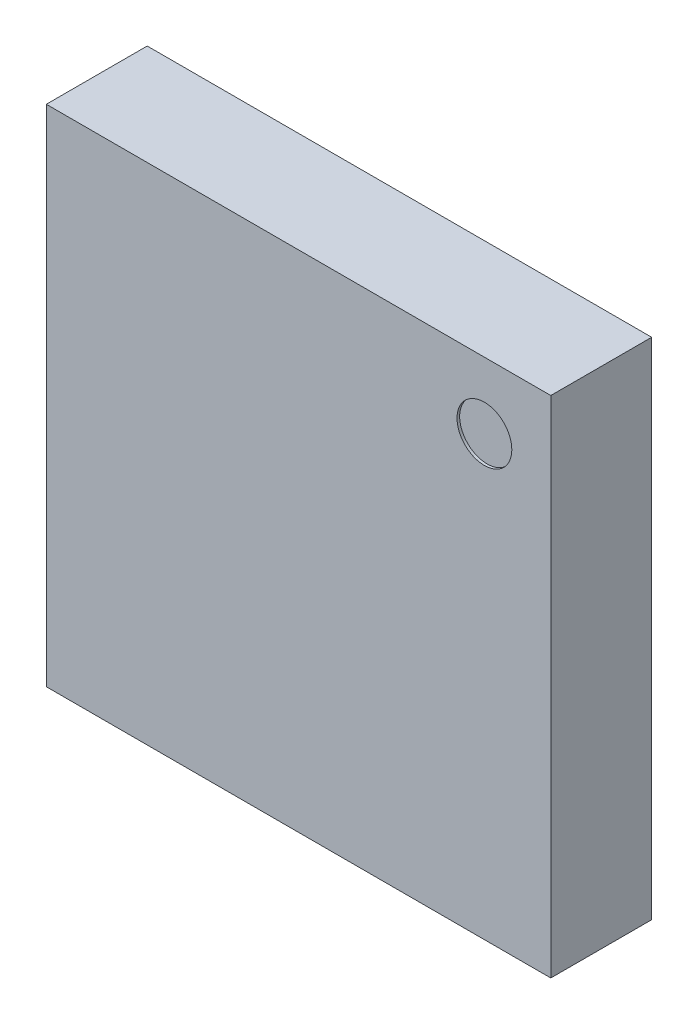
ISO-10303-21;
HEADER;
FILE_DESCRIPTION(('STEP AP214'),'2;1');
FILE_NAME('part.step','',(''),(''),'','','');
FILE_SCHEMA(('AUTOMOTIVE_DESIGN { 1 0 10303 214 1 1 1 1 }'));
ENDSEC;
DATA;
#1=APPLICATION_CONTEXT('core data for automotive mechanical design processes');
#2=APPLICATION_PROTOCOL_DEFINITION('international standard','automotive_design',2000,#1);
#3=PRODUCT_CONTEXT('',#1,'mechanical');
#4=PRODUCT('Part','Part','',(#3));
#5=PRODUCT_RELATED_PRODUCT_CATEGORY('part','',(#4));
#6=PRODUCT_DEFINITION_FORMATION('','',#4);
#7=PRODUCT_DEFINITION_CONTEXT('part definition',#1,'design');
#8=PRODUCT_DEFINITION('design','',#6,#7);
#9=PRODUCT_DEFINITION_SHAPE('','',#8);
#10=(LENGTH_UNIT() NAMED_UNIT(*) SI_UNIT(.MILLI.,.METRE.));
#11=(NAMED_UNIT(*) PLANE_ANGLE_UNIT() SI_UNIT($,.RADIAN.));
#12=(NAMED_UNIT(*) SI_UNIT($,.STERADIAN.) SOLID_ANGLE_UNIT());
#13=UNCERTAINTY_MEASURE_WITH_UNIT(LENGTH_MEASURE(1.E-05),#10,'distance_accuracy_value','');
#14=(GEOMETRIC_REPRESENTATION_CONTEXT(3) GLOBAL_UNCERTAINTY_ASSIGNED_CONTEXT((#13)) GLOBAL_UNIT_ASSIGNED_CONTEXT((#10,
#11,#12)) REPRESENTATION_CONTEXT('',''));
#15=CARTESIAN_POINT('',(0.,0.,0.));
#16=DIRECTION('',(0.,0.,1.));
#17=DIRECTION('',(1.,0.,0.));
#18=AXIS2_PLACEMENT_3D('',#15,#16,#17);
#19=CARTESIAN_POINT('',(0.95,0.95,0.38));
#20=DIRECTION('',(-1.,0.,0.));
#21=DIRECTION('',(0.,-1.,0.));
#22=AXIS2_PLACEMENT_3D('',#19,#20,#21);
#23=PLANE('',#22);
#24=DIRECTION('',(0.,1.,0.));
#25=VECTOR('',#24,1.);
#26=CARTESIAN_POINT('',(0.95,0.95,0.));
#27=LINE('',#26,#25);
#28=CARTESIAN_POINT('',(0.95,-0.95,0.));
#29=VERTEX_POINT('',#28);
#30=CARTESIAN_POINT('',(0.95,0.95,0.));
#31=VERTEX_POINT('',#30);
#32=EDGE_CURVE('E124',#29,#31,#27,.T.);
#33=ORIENTED_EDGE('',*,*,#32,.T.);
#34=DIRECTION('',(0.,0.,-1.));
#35=VECTOR('',#34,1.);
#36=CARTESIAN_POINT('',(0.95,0.95,0.38));
#37=LINE('',#36,#35);
#38=CARTESIAN_POINT('',(0.95,0.95,0.38));
#39=VERTEX_POINT('',#38);
#40=EDGE_CURVE('E113',#39,#31,#37,.T.);
#41=ORIENTED_EDGE('',*,*,#40,.F.);
#42=DIRECTION('',(0.,1.,0.));
#43=VECTOR('',#42,1.);
#44=CARTESIAN_POINT('',(0.95,0.95,0.38));
#45=LINE('',#44,#43);
#46=CARTESIAN_POINT('',(0.95,-0.95,0.38));
#47=VERTEX_POINT('',#46);
#48=EDGE_CURVE('E105',#47,#39,#45,.T.);
#49=ORIENTED_EDGE('',*,*,#48,.F.);
#50=DIRECTION('',(0.,0.,-1.));
#51=VECTOR('',#50,1.);
#52=CARTESIAN_POINT('',(0.95,-0.95,0.38));
#53=LINE('',#52,#51);
#54=EDGE_CURVE('E120',#47,#29,#53,.T.);
#55=ORIENTED_EDGE('',*,*,#54,.T.);
#56=EDGE_LOOP('',(#33,#41,#49,#55));
#57=FACE_BOUND('',#56,.T.);
#58=ADVANCED_FACE('F51',(#57),#23,.F.);
#59=CARTESIAN_POINT('',(-0.95,0.95,0.38));
#60=DIRECTION('',(0.,-1.,0.));
#61=DIRECTION('',(0.,0.,-1.));
#62=AXIS2_PLACEMENT_3D('',#59,#60,#61);
#63=PLANE('',#62);
#64=DIRECTION('',(-1.,0.,0.));
#65=VECTOR('',#64,1.);
#66=CARTESIAN_POINT('',(-0.95,0.95,0.));
#67=LINE('',#66,#65);
#68=CARTESIAN_POINT('',(-0.95,0.95,0.));
#69=VERTEX_POINT('',#68);
#70=EDGE_CURVE('E111',#31,#69,#67,.T.);
#71=ORIENTED_EDGE('',*,*,#70,.T.);
#72=DIRECTION('',(0.,0.,-1.));
#73=VECTOR('',#72,1.);
#74=CARTESIAN_POINT('',(-0.95,0.95,0.38));
#75=LINE('',#74,#73);
#76=CARTESIAN_POINT('',(-0.95,0.95,0.38));
#77=VERTEX_POINT('',#76);
#78=EDGE_CURVE('E109',#77,#69,#75,.T.);
#79=ORIENTED_EDGE('',*,*,#78,.F.);
#80=DIRECTION('',(-1.,0.,0.));
#81=VECTOR('',#80,1.);
#82=CARTESIAN_POINT('',(-0.95,0.95,0.38));
#83=LINE('',#82,#81);
#84=EDGE_CURVE('E100',#39,#77,#83,.T.);
#85=ORIENTED_EDGE('',*,*,#84,.F.);
#86=ORIENTED_EDGE('',*,*,#40,.T.);
#87=EDGE_LOOP('',(#71,#79,#85,#86));
#88=FACE_BOUND('',#87,.T.);
#89=ADVANCED_FACE('F110',(#88),#63,.F.);
#90=CARTESIAN_POINT('',(-0.95,0.95,0.38));
#91=DIRECTION('',(1.,0.,0.));
#92=DIRECTION('',(0.,1.,0.));
#93=AXIS2_PLACEMENT_3D('',#90,#91,#92);
#94=PLANE('',#93);
#95=DIRECTION('',(0.,-1.,0.));
#96=VECTOR('',#95,1.);
#97=CARTESIAN_POINT('',(-0.95,0.95,0.));
#98=LINE('',#97,#96);
#99=CARTESIAN_POINT('',(-0.95,-0.95,0.));
#100=VERTEX_POINT('',#99);
#101=EDGE_CURVE('E86',#69,#100,#98,.T.);
#102=ORIENTED_EDGE('',*,*,#101,.T.);
#103=DIRECTION('',(0.,0.,-1.));
#104=VECTOR('',#103,1.);
#105=CARTESIAN_POINT('',(-0.95,-0.95,0.38));
#106=LINE('',#105,#104);
#107=CARTESIAN_POINT('',(-0.95,-0.95,0.38));
#108=VERTEX_POINT('',#107);
#109=EDGE_CURVE('E114',#108,#100,#106,.T.);
#110=ORIENTED_EDGE('',*,*,#109,.F.);
#111=DIRECTION('',(0.,-1.,0.));
#112=VECTOR('',#111,1.);
#113=CARTESIAN_POINT('',(-0.95,0.95,0.38));
#114=LINE('',#113,#112);
#115=EDGE_CURVE('E103',#77,#108,#114,.T.);
#116=ORIENTED_EDGE('',*,*,#115,.F.);
#117=ORIENTED_EDGE('',*,*,#78,.T.);
#118=EDGE_LOOP('',(#102,#110,#116,#117));
#119=FACE_BOUND('',#118,.T.);
#120=ADVANCED_FACE('F116',(#119),#94,.F.);
#121=CARTESIAN_POINT('',(-0.95,-0.95,0.38));
#122=DIRECTION('',(0.,1.,0.));
#123=DIRECTION('',(0.,0.,1.));
#124=AXIS2_PLACEMENT_3D('',#121,#122,#123);
#125=PLANE('',#124);
#126=DIRECTION('',(1.,0.,0.));
#127=VECTOR('',#126,1.);
#128=CARTESIAN_POINT('',(-0.95,-0.95,0.));
#129=LINE('',#128,#127);
#130=EDGE_CURVE('E92',#100,#29,#129,.T.);
#131=ORIENTED_EDGE('',*,*,#130,.T.);
#132=ORIENTED_EDGE('',*,*,#54,.F.);
#133=DIRECTION('',(1.,0.,0.));
#134=VECTOR('',#133,1.);
#135=CARTESIAN_POINT('',(-0.95,-0.95,0.38));
#136=LINE('',#135,#134);
#137=EDGE_CURVE('E69',#108,#47,#136,.T.);
#138=ORIENTED_EDGE('',*,*,#137,.F.);
#139=ORIENTED_EDGE('',*,*,#109,.T.);
#140=EDGE_LOOP('',(#131,#132,#138,#139));
#141=FACE_BOUND('',#140,.T.);
#142=ADVANCED_FACE('F226',(#141),#125,.F.);
#143=CARTESIAN_POINT('',(0.,0.,0.38));
#144=DIRECTION('',(0.,0.,1.));
#145=DIRECTION('',(1.,0.,0.));
#146=AXIS2_PLACEMENT_3D('',#143,#144,#145);
#147=PLANE('',#146);
#148=CARTESIAN_POINT('',(0.7,0.7,0.38));
#149=DIRECTION('',(0.,0.,1.));
#150=DIRECTION('',(1.,0.,0.));
#151=AXIS2_PLACEMENT_3D('',#148,#149,#150);
#152=CIRCLE('',#151,0.103231073137748);
#153=CARTESIAN_POINT('',(0.803231073137748,0.7,0.38));
#154=VERTEX_POINT('',#153);
#155=EDGE_CURVE('E313',#154,#154,#152,.T.);
#156=ORIENTED_EDGE('',*,*,#155,.F.);
#157=EDGE_LOOP('',(#156));
#158=FACE_BOUND('',#157,.T.);
#159=ORIENTED_EDGE('',*,*,#48,.T.);
#160=ORIENTED_EDGE('',*,*,#84,.T.);
#161=ORIENTED_EDGE('',*,*,#115,.T.);
#162=ORIENTED_EDGE('',*,*,#137,.T.);
#163=EDGE_LOOP('',(#159,#160,#161,#162));
#164=FACE_BOUND('',#163,.T.);
#165=ADVANCED_FACE('F101',(#158,#164),#147,.T.);
#166=CARTESIAN_POINT('',(0.,0.,0.));
#167=DIRECTION('',(0.,0.,1.));
#168=DIRECTION('',(1.,0.,0.));
#169=AXIS2_PLACEMENT_3D('',#166,#167,#168);
#170=PLANE('',#169);
#171=CARTESIAN_POINT('',(-0.750000000000016,-0.75,0.));
#172=DIRECTION('',(0.,0.,1.));
#173=DIRECTION('',(1.,0.,0.));
#174=AXIS2_PLACEMENT_3D('',#171,#172,#173);
#175=CIRCLE('',#174,0.125);
#176=CARTESIAN_POINT('',(-0.625000000000016,-0.75,0.));
#177=VERTEX_POINT('',#176);
#178=EDGE_CURVE('E11',#177,#177,#175,.F.);
#179=ORIENTED_EDGE('',*,*,#178,.F.);
#180=EDGE_LOOP('',(#179));
#181=FACE_BOUND('',#180,.T.);
#182=CARTESIAN_POINT('',(-0.75000000000001,-0.25,0.));
#183=DIRECTION('',(0.,0.,1.));
#184=DIRECTION('',(1.,0.,0.));
#185=AXIS2_PLACEMENT_3D('',#182,#183,#184);
#186=CIRCLE('',#185,0.125);
#187=CARTESIAN_POINT('',(-0.62500000000001,-0.25,0.));
#188=VERTEX_POINT('',#187);
#189=EDGE_CURVE('E61',#188,#188,#186,.F.);
#190=ORIENTED_EDGE('',*,*,#189,.F.);
#191=EDGE_LOOP('',(#190));
#192=FACE_BOUND('',#191,.T.);
#193=CARTESIAN_POINT('',(-0.750000000000005,0.25,0.));
#194=DIRECTION('',(0.,0.,1.));
#195=DIRECTION('',(1.,0.,0.));
#196=AXIS2_PLACEMENT_3D('',#193,#194,#195);
#197=CIRCLE('',#196,0.125);
#198=CARTESIAN_POINT('',(-0.625000000000005,0.25,0.));
#199=VERTEX_POINT('',#198);
#200=EDGE_CURVE('E185',#199,#199,#197,.F.);
#201=ORIENTED_EDGE('',*,*,#200,.F.);
#202=EDGE_LOOP('',(#201));
#203=FACE_BOUND('',#202,.T.);
#204=CARTESIAN_POINT('',(0.749999999999984,-0.75000000000001,0.));
#205=DIRECTION('',(0.,0.,1.));
#206=DIRECTION('',(1.,0.,0.));
#207=AXIS2_PLACEMENT_3D('',#204,#205,#206);
#208=CIRCLE('',#207,0.125);
#209=CARTESIAN_POINT('',(0.874999999999984,-0.75000000000001,0.));
#210=VERTEX_POINT('',#209);
#211=EDGE_CURVE('E181',#210,#210,#208,.F.);
#212=ORIENTED_EDGE('',*,*,#211,.F.);
#213=EDGE_LOOP('',(#212));
#214=FACE_BOUND('',#213,.T.);
#215=CARTESIAN_POINT('',(0.249999999999984,-0.750000000000007,0.));
#216=DIRECTION('',(0.,0.,1.));
#217=DIRECTION('',(1.,0.,0.));
#218=AXIS2_PLACEMENT_3D('',#215,#216,#217);
#219=CIRCLE('',#218,0.125);
#220=CARTESIAN_POINT('',(0.374999999999984,-0.750000000000007,0.));
#221=VERTEX_POINT('',#220);
#222=EDGE_CURVE('E177',#221,#221,#219,.F.);
#223=ORIENTED_EDGE('',*,*,#222,.F.);
#224=EDGE_LOOP('',(#223));
#225=FACE_BOUND('',#224,.T.);
#226=CARTESIAN_POINT('',(-0.250000000000016,-0.750000000000003,0.));
#227=DIRECTION('',(0.,0.,1.));
#228=DIRECTION('',(1.,0.,0.));
#229=AXIS2_PLACEMENT_3D('',#226,#227,#228);
#230=CIRCLE('',#229,0.125);
#231=CARTESIAN_POINT('',(-0.125000000000016,-0.750000000000003,0.));
#232=VERTEX_POINT('',#231);
#233=EDGE_CURVE('E173',#232,#232,#230,.F.);
#234=ORIENTED_EDGE('',*,*,#233,.F.);
#235=EDGE_LOOP('',(#234));
#236=FACE_BOUND('',#235,.T.);
#237=CARTESIAN_POINT('',(0.74999999999999,-0.25000000000001,0.));
#238=DIRECTION('',(0.,0.,1.));
#239=DIRECTION('',(1.,0.,0.));
#240=AXIS2_PLACEMENT_3D('',#237,#238,#239);
#241=CIRCLE('',#240,0.125);
#242=CARTESIAN_POINT('',(0.87499999999999,-0.25000000000001,0.));
#243=VERTEX_POINT('',#242);
#244=EDGE_CURVE('E169',#243,#243,#241,.F.);
#245=ORIENTED_EDGE('',*,*,#244,.F.);
#246=EDGE_LOOP('',(#245));
#247=FACE_BOUND('',#246,.T.);
#248=CARTESIAN_POINT('',(0.24999999999999,-0.250000000000007,0.));
#249=DIRECTION('',(0.,0.,1.));
#250=DIRECTION('',(1.,0.,0.));
#251=AXIS2_PLACEMENT_3D('',#248,#249,#250);
#252=CIRCLE('',#251,0.125);
#253=CARTESIAN_POINT('',(0.37499999999999,-0.250000000000007,0.));
#254=VERTEX_POINT('',#253);
#255=EDGE_CURVE('E165',#254,#254,#252,.F.);
#256=ORIENTED_EDGE('',*,*,#255,.F.);
#257=EDGE_LOOP('',(#256));
#258=FACE_BOUND('',#257,.T.);
#259=CARTESIAN_POINT('',(-0.25000000000001,-0.250000000000003,0.));
#260=DIRECTION('',(0.,0.,1.));
#261=DIRECTION('',(1.,0.,0.));
#262=AXIS2_PLACEMENT_3D('',#259,#260,#261);
#263=CIRCLE('',#262,0.125);
#264=CARTESIAN_POINT('',(-0.12500000000001,-0.250000000000003,0.));
#265=VERTEX_POINT('',#264);
#266=EDGE_CURVE('E161',#265,#265,#263,.F.);
#267=ORIENTED_EDGE('',*,*,#266,.F.);
#268=EDGE_LOOP('',(#267));
#269=FACE_BOUND('',#268,.T.);
#270=CARTESIAN_POINT('',(0.749999999999995,0.249999999999989,0.));
#271=DIRECTION('',(0.,0.,1.));
#272=DIRECTION('',(1.,0.,0.));
#273=AXIS2_PLACEMENT_3D('',#270,#271,#272);
#274=CIRCLE('',#273,0.125);
#275=CARTESIAN_POINT('',(0.874999999999995,0.249999999999989,0.));
#276=VERTEX_POINT('',#275);
#277=EDGE_CURVE('E157',#276,#276,#274,.F.);
#278=ORIENTED_EDGE('',*,*,#277,.F.);
#279=EDGE_LOOP('',(#278));
#280=FACE_BOUND('',#279,.T.);
#281=CARTESIAN_POINT('',(0.75,0.749999999999989,0.));
#282=DIRECTION('',(0.,0.,1.));
#283=DIRECTION('',(1.,0.,0.));
#284=AXIS2_PLACEMENT_3D('',#281,#282,#283);
#285=CIRCLE('',#284,0.125);
#286=CARTESIAN_POINT('',(0.875,0.749999999999989,0.));
#287=VERTEX_POINT('',#286);
#288=EDGE_CURVE('E153',#287,#287,#285,.F.);
#289=ORIENTED_EDGE('',*,*,#288,.F.);
#290=EDGE_LOOP('',(#289));
#291=FACE_BOUND('',#290,.T.);
#292=CARTESIAN_POINT('',(0.25,0.749999999999993,0.));
#293=DIRECTION('',(0.,0.,1.));
#294=DIRECTION('',(1.,0.,0.));
#295=AXIS2_PLACEMENT_3D('',#292,#293,#294);
#296=CIRCLE('',#295,0.125);
#297=CARTESIAN_POINT('',(0.375,0.749999999999993,0.));
#298=VERTEX_POINT('',#297);
#299=EDGE_CURVE('E149',#298,#298,#296,.F.);
#300=ORIENTED_EDGE('',*,*,#299,.F.);
#301=EDGE_LOOP('',(#300));
#302=FACE_BOUND('',#301,.T.);
#303=CARTESIAN_POINT('',(-0.25,0.749999999999997,0.));
#304=DIRECTION('',(0.,0.,1.));
#305=DIRECTION('',(1.,0.,0.));
#306=AXIS2_PLACEMENT_3D('',#303,#304,#305);
#307=CIRCLE('',#306,0.125);
#308=CARTESIAN_POINT('',(-0.125,0.749999999999997,0.));
#309=VERTEX_POINT('',#308);
#310=EDGE_CURVE('E145',#309,#309,#307,.F.);
#311=ORIENTED_EDGE('',*,*,#310,.F.);
#312=EDGE_LOOP('',(#311));
#313=FACE_BOUND('',#312,.T.);
#314=CARTESIAN_POINT('',(-0.75,0.750000000000005,0.));
#315=DIRECTION('',(0.,0.,1.));
#316=DIRECTION('',(1.,0.,0.));
#317=AXIS2_PLACEMENT_3D('',#314,#315,#316);
#318=CIRCLE('',#317,0.124999999999999);
#319=CARTESIAN_POINT('',(-0.625000000000001,0.750000000000005,0.));
#320=VERTEX_POINT('',#319);
#321=EDGE_CURVE('E141',#320,#320,#318,.F.);
#322=ORIENTED_EDGE('',*,*,#321,.F.);
#323=EDGE_LOOP('',(#322));
#324=FACE_BOUND('',#323,.T.);
#325=ORIENTED_EDGE('',*,*,#32,.F.);
#326=ORIENTED_EDGE('',*,*,#130,.F.);
#327=ORIENTED_EDGE('',*,*,#101,.F.);
#328=ORIENTED_EDGE('',*,*,#70,.F.);
#329=EDGE_LOOP('',(#325,#326,#327,#328));
#330=FACE_BOUND('',#329,.T.);
#331=ADVANCED_FACE('F194',(#181,#192,#203,#214,#225,#236,#247,#258,#269,#280,#291,#302,#313,
#324,#330),#170,.F.);
#332=CARTESIAN_POINT('',(-0.750000000000016,-0.75,0.));
#333=DIRECTION('',(0.,0.,-1.));
#334=DIRECTION('',(-1.,0.,0.));
#335=AXIS2_PLACEMENT_3D('',#332,#333,#334);
#336=SPHERICAL_SURFACE('',#335,0.125);
#337=ORIENTED_EDGE('',*,*,#178,.T.);
#338=EDGE_LOOP('',(#337));
#339=FACE_BOUND('',#338,.T.);
#340=ADVANCED_FACE('F197',(#339),#336,.T.);
#341=CARTESIAN_POINT('',(-0.250000000000016,-0.750000000000003,0.));
#342=DIRECTION('',(0.,0.,-1.));
#343=DIRECTION('',(-1.,0.,0.));
#344=AXIS2_PLACEMENT_3D('',#341,#342,#343);
#345=SPHERICAL_SURFACE('',#344,0.125);
#346=ORIENTED_EDGE('',*,*,#233,.T.);
#347=EDGE_LOOP('',(#346));
#348=FACE_BOUND('',#347,.T.);
#349=ADVANCED_FACE('F246',(#348),#345,.T.);
#350=CARTESIAN_POINT('',(0.249999999999984,-0.750000000000007,0.));
#351=DIRECTION('',(0.,0.,-1.));
#352=DIRECTION('',(-1.,0.,0.));
#353=AXIS2_PLACEMENT_3D('',#350,#351,#352);
#354=SPHERICAL_SURFACE('',#353,0.125);
#355=ORIENTED_EDGE('',*,*,#222,.T.);
#356=EDGE_LOOP('',(#355));
#357=FACE_BOUND('',#356,.T.);
#358=ADVANCED_FACE('F250',(#357),#354,.T.);
#359=CARTESIAN_POINT('',(0.24999999999999,-0.250000000000007,0.));
#360=DIRECTION('',(0.,0.,-1.));
#361=DIRECTION('',(-1.,0.,0.));
#362=AXIS2_PLACEMENT_3D('',#359,#360,#361);
#363=SPHERICAL_SURFACE('',#362,0.125);
#364=ORIENTED_EDGE('',*,*,#255,.T.);
#365=EDGE_LOOP('',(#364));
#366=FACE_BOUND('',#365,.T.);
#367=ADVANCED_FACE('F254',(#366),#363,.T.);
#368=CARTESIAN_POINT('',(-0.25000000000001,-0.250000000000003,0.));
#369=DIRECTION('',(0.,0.,-1.));
#370=DIRECTION('',(-1.,0.,0.));
#371=AXIS2_PLACEMENT_3D('',#368,#369,#370);
#372=SPHERICAL_SURFACE('',#371,0.125);
#373=ORIENTED_EDGE('',*,*,#266,.T.);
#374=EDGE_LOOP('',(#373));
#375=FACE_BOUND('',#374,.T.);
#376=ADVANCED_FACE('F258',(#375),#372,.T.);
#377=CARTESIAN_POINT('',(-0.75000000000001,-0.25,0.));
#378=DIRECTION('',(0.,0.,-1.));
#379=DIRECTION('',(-1.,0.,0.));
#380=AXIS2_PLACEMENT_3D('',#377,#378,#379);
#381=SPHERICAL_SURFACE('',#380,0.125);
#382=ORIENTED_EDGE('',*,*,#189,.T.);
#383=EDGE_LOOP('',(#382));
#384=FACE_BOUND('',#383,.T.);
#385=ADVANCED_FACE('F192',(#384),#381,.T.);
#386=CARTESIAN_POINT('',(-0.750000000000005,0.25,0.));
#387=DIRECTION('',(0.,0.,-1.));
#388=DIRECTION('',(-1.,0.,0.));
#389=AXIS2_PLACEMENT_3D('',#386,#387,#388);
#390=SPHERICAL_SURFACE('',#389,0.125);
#391=ORIENTED_EDGE('',*,*,#200,.T.);
#392=EDGE_LOOP('',(#391));
#393=FACE_BOUND('',#392,.T.);
#394=ADVANCED_FACE('F265',(#393),#390,.T.);
#395=CARTESIAN_POINT('',(-0.75,0.750000000000005,0.));
#396=DIRECTION('',(0.,0.,-1.));
#397=DIRECTION('',(-1.,0.,0.));
#398=AXIS2_PLACEMENT_3D('',#395,#396,#397);
#399=SPHERICAL_SURFACE('',#398,0.125);
#400=ORIENTED_EDGE('',*,*,#321,.T.);
#401=EDGE_LOOP('',(#400));
#402=FACE_BOUND('',#401,.T.);
#403=ADVANCED_FACE('F268',(#402),#399,.T.);
#404=CARTESIAN_POINT('',(-0.25,0.749999999999997,0.));
#405=DIRECTION('',(0.,0.,-1.));
#406=DIRECTION('',(-1.,0.,0.));
#407=AXIS2_PLACEMENT_3D('',#404,#405,#406);
#408=SPHERICAL_SURFACE('',#407,0.125);
#409=ORIENTED_EDGE('',*,*,#310,.T.);
#410=EDGE_LOOP('',(#409));
#411=FACE_BOUND('',#410,.T.);
#412=ADVANCED_FACE('F272',(#411),#408,.T.);
#413=CARTESIAN_POINT('',(0.25,0.749999999999993,0.));
#414=DIRECTION('',(0.,0.,-1.));
#415=DIRECTION('',(-1.,0.,0.));
#416=AXIS2_PLACEMENT_3D('',#413,#414,#415);
#417=SPHERICAL_SURFACE('',#416,0.125);
#418=ORIENTED_EDGE('',*,*,#299,.T.);
#419=EDGE_LOOP('',(#418));
#420=FACE_BOUND('',#419,.T.);
#421=ADVANCED_FACE('F276',(#420),#417,.T.);
#422=CARTESIAN_POINT('',(0.75,0.749999999999989,0.));
#423=DIRECTION('',(0.,0.,-1.));
#424=DIRECTION('',(-1.,0.,0.));
#425=AXIS2_PLACEMENT_3D('',#422,#423,#424);
#426=SPHERICAL_SURFACE('',#425,0.125);
#427=ORIENTED_EDGE('',*,*,#288,.T.);
#428=EDGE_LOOP('',(#427));
#429=FACE_BOUND('',#428,.T.);
#430=ADVANCED_FACE('F280',(#429),#426,.T.);
#431=CARTESIAN_POINT('',(0.749999999999995,0.249999999999989,0.));
#432=DIRECTION('',(0.,0.,-1.));
#433=DIRECTION('',(-1.,0.,0.));
#434=AXIS2_PLACEMENT_3D('',#431,#432,#433);
#435=SPHERICAL_SURFACE('',#434,0.125);
#436=ORIENTED_EDGE('',*,*,#277,.T.);
#437=EDGE_LOOP('',(#436));
#438=FACE_BOUND('',#437,.T.);
#439=ADVANCED_FACE('F284',(#438),#435,.T.);
#440=CARTESIAN_POINT('',(0.74999999999999,-0.25000000000001,0.));
#441=DIRECTION('',(0.,0.,-1.));
#442=DIRECTION('',(-1.,0.,0.));
#443=AXIS2_PLACEMENT_3D('',#440,#441,#442);
#444=SPHERICAL_SURFACE('',#443,0.125);
#445=ORIENTED_EDGE('',*,*,#244,.T.);
#446=EDGE_LOOP('',(#445));
#447=FACE_BOUND('',#446,.T.);
#448=ADVANCED_FACE('F287',(#447),#444,.T.);
#449=CARTESIAN_POINT('',(0.749999999999984,-0.75000000000001,0.));
#450=DIRECTION('',(0.,0.,-1.));
#451=DIRECTION('',(-1.,0.,0.));
#452=AXIS2_PLACEMENT_3D('',#449,#450,#451);
#453=SPHERICAL_SURFACE('',#452,0.125);
#454=ORIENTED_EDGE('',*,*,#211,.T.);
#455=EDGE_LOOP('',(#454));
#456=FACE_BOUND('',#455,.T.);
#457=ADVANCED_FACE('F53',(#456),#453,.T.);
#458=CARTESIAN_POINT('',(0.7,0.7,0.37));
#459=DIRECTION('',(0.,0.,1.));
#460=DIRECTION('',(1.,0.,0.));
#461=AXIS2_PLACEMENT_3D('',#458,#459,#460);
#462=CYLINDRICAL_SURFACE('',#461,0.103231073137748);
#463=CARTESIAN_POINT('',(0.7,0.7,0.37));
#464=DIRECTION('',(0.,0.,1.));
#465=DIRECTION('',(1.,0.,0.));
#466=AXIS2_PLACEMENT_3D('',#463,#464,#465);
#467=CIRCLE('',#466,0.103231073137748);
#468=CARTESIAN_POINT('',(0.803231073137748,0.7,0.37));
#469=VERTEX_POINT('',#468);
#470=EDGE_CURVE('E128',#469,#469,#467,.T.);
#471=ORIENTED_EDGE('',*,*,#470,.F.);
#472=EDGE_LOOP('',(#471));
#473=FACE_BOUND('',#472,.T.);
#474=ORIENTED_EDGE('',*,*,#155,.T.);
#475=EDGE_LOOP('',(#474));
#476=FACE_BOUND('',#475,.T.);
#477=ADVANCED_FACE('F294',(#473,#476),#462,.F.);
#478=CARTESIAN_POINT('',(0.7,0.7,0.37));
#479=DIRECTION('',(0.,0.,1.));
#480=DIRECTION('',(1.,0.,0.));
#481=AXIS2_PLACEMENT_3D('',#478,#479,#480);
#482=PLANE('',#481);
#483=ORIENTED_EDGE('',*,*,#470,.T.);
#484=EDGE_LOOP('',(#483));
#485=FACE_BOUND('',#484,.T.);
#486=ADVANCED_FACE('F299',(#485),#482,.T.);
#487=CLOSED_SHELL('',(#58,#89,#120,#142,#165,#331,#340,#349,#358,#367,#376,#385,#394,#403,#412,
#421,#430,#439,#448,#457,#477,#486));
#488=MANIFOLD_SOLID_BREP('B2',#487);
#489=ADVANCED_BREP_SHAPE_REPRESENTATION('',(#18,#488),#14);
#490=SHAPE_DEFINITION_REPRESENTATION(#9,#489);
ENDSEC;
END-ISO-10303-21;
